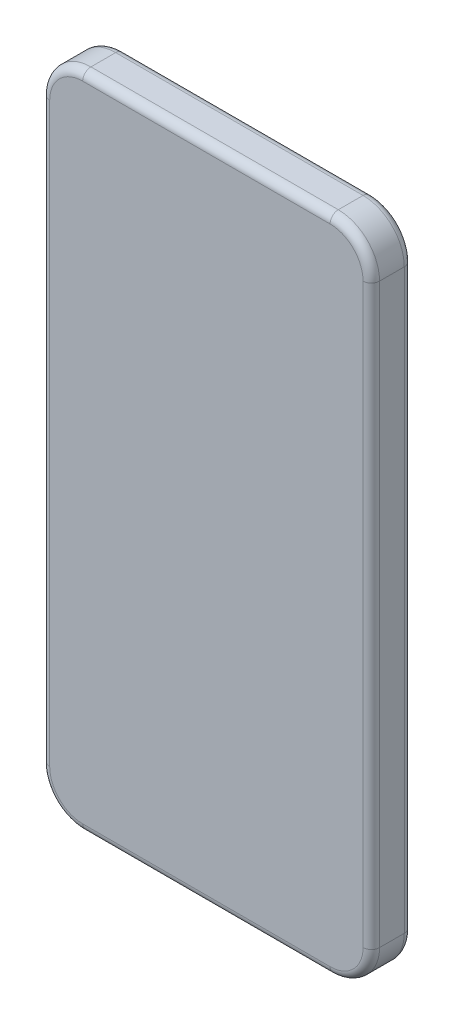
ISO-10303-21;
HEADER;
FILE_DESCRIPTION(('STEP AP214'),'2;1');
FILE_NAME('part.step','',(''),(''),'','','');
FILE_SCHEMA(('AUTOMOTIVE_DESIGN { 1 0 10303 214 1 1 1 1 }'));
ENDSEC;
DATA;
#1=APPLICATION_CONTEXT('core data for automotive mechanical design processes');
#2=APPLICATION_PROTOCOL_DEFINITION('international standard','automotive_design',2000,#1);
#3=PRODUCT_CONTEXT('',#1,'mechanical');
#4=PRODUCT('Part','Part','',(#3));
#5=PRODUCT_RELATED_PRODUCT_CATEGORY('part','',(#4));
#6=PRODUCT_DEFINITION_FORMATION('','',#4);
#7=PRODUCT_DEFINITION_CONTEXT('part definition',#1,'design');
#8=PRODUCT_DEFINITION('design','',#6,#7);
#9=PRODUCT_DEFINITION_SHAPE('','',#8);
#10=(LENGTH_UNIT() NAMED_UNIT(*) SI_UNIT(.MILLI.,.METRE.));
#11=(NAMED_UNIT(*) PLANE_ANGLE_UNIT() SI_UNIT($,.RADIAN.));
#12=(NAMED_UNIT(*) SI_UNIT($,.STERADIAN.) SOLID_ANGLE_UNIT());
#13=UNCERTAINTY_MEASURE_WITH_UNIT(LENGTH_MEASURE(1.E-05),#10,'distance_accuracy_value','');
#14=(GEOMETRIC_REPRESENTATION_CONTEXT(3) GLOBAL_UNCERTAINTY_ASSIGNED_CONTEXT((#13)) GLOBAL_UNIT_ASSIGNED_CONTEXT((#10,
#11,#12)) REPRESENTATION_CONTEXT('',''));
#15=CARTESIAN_POINT('',(0.,0.,0.));
#16=DIRECTION('',(0.,0.,1.));
#17=DIRECTION('',(1.,0.,0.));
#18=AXIS2_PLACEMENT_3D('',#15,#16,#17);
#19=CARTESIAN_POINT('',(30.,-70.,10.));
#20=DIRECTION('',(0.,0.,-1.));
#21=DIRECTION('',(-1.,0.,0.));
#22=AXIS2_PLACEMENT_3D('',#19,#20,#21);
#23=CYLINDRICAL_SURFACE('',#22,10.);
#24=DIRECTION('',(0.,0.,-1.));
#25=VECTOR('',#24,1.);
#26=CARTESIAN_POINT('',(29.9999999999999,-80.,10.));
#27=LINE('',#26,#25);
#28=CARTESIAN_POINT('',(29.9999999999999,-80.,8.));
#29=VERTEX_POINT('',#28);
#30=CARTESIAN_POINT('',(29.9999999999999,-80.,2.));
#31=VERTEX_POINT('',#30);
#32=EDGE_CURVE('E314',#29,#31,#27,.T.);
#33=ORIENTED_EDGE('',*,*,#32,.T.);
#34=CARTESIAN_POINT('',(30.,-70.,2.));
#35=DIRECTION('',(0.,0.,-1.));
#36=DIRECTION('',(-1.,0.,0.));
#37=AXIS2_PLACEMENT_3D('',#34,#35,#36);
#38=CIRCLE('',#37,10.);
#39=CARTESIAN_POINT('',(40.,-70.,2.));
#40=VERTEX_POINT('',#39);
#41=EDGE_CURVE('E263',#31,#40,#38,.F.);
#42=ORIENTED_EDGE('',*,*,#41,.T.);
#43=DIRECTION('',(0.,0.,-1.));
#44=VECTOR('',#43,1.);
#45=CARTESIAN_POINT('',(40.,-70.,10.));
#46=LINE('',#45,#44);
#47=CARTESIAN_POINT('',(40.,-70.,8.));
#48=VERTEX_POINT('',#47);
#49=EDGE_CURVE('E178',#48,#40,#46,.T.);
#50=ORIENTED_EDGE('',*,*,#49,.F.);
#51=CARTESIAN_POINT('',(30.,-70.,8.));
#52=DIRECTION('',(0.,0.,-1.));
#53=DIRECTION('',(-1.,0.,0.));
#54=AXIS2_PLACEMENT_3D('',#51,#52,#53);
#55=CIRCLE('',#54,10.);
#56=EDGE_CURVE('E260',#48,#29,#55,.T.);
#57=ORIENTED_EDGE('',*,*,#56,.T.);
#58=EDGE_LOOP('',(#33,#42,#50,#57));
#59=FACE_BOUND('',#58,.T.);
#60=ADVANCED_FACE('F39',(#59),#23,.T.);
#61=CARTESIAN_POINT('',(40.,69.9999999999999,10.));
#62=DIRECTION('',(-1.,0.,0.));
#63=DIRECTION('',(0.,-1.,0.));
#64=AXIS2_PLACEMENT_3D('',#61,#62,#63);
#65=PLANE('',#64);
#66=ORIENTED_EDGE('',*,*,#49,.T.);
#67=DIRECTION('',(0.,1.,0.));
#68=VECTOR('',#67,1.);
#69=CARTESIAN_POINT('',(40.,69.9999999999999,2.));
#70=LINE('',#69,#68);
#71=CARTESIAN_POINT('',(40.,69.9999999999999,2.));
#72=VERTEX_POINT('',#71);
#73=EDGE_CURVE('E176',#40,#72,#70,.T.);
#74=ORIENTED_EDGE('',*,*,#73,.T.);
#75=DIRECTION('',(0.,0.,-1.));
#76=VECTOR('',#75,1.);
#77=CARTESIAN_POINT('',(40.,69.9999999999999,10.));
#78=LINE('',#77,#76);
#79=CARTESIAN_POINT('',(40.,69.9999999999999,8.));
#80=VERTEX_POINT('',#79);
#81=EDGE_CURVE('E157',#80,#72,#78,.T.);
#82=ORIENTED_EDGE('',*,*,#81,.F.);
#83=DIRECTION('',(0.,1.,0.));
#84=VECTOR('',#83,1.);
#85=CARTESIAN_POINT('',(40.,69.9999999999999,8.));
#86=LINE('',#85,#84);
#87=EDGE_CURVE('E173',#80,#48,#86,.F.);
#88=ORIENTED_EDGE('',*,*,#87,.T.);
#89=EDGE_LOOP('',(#66,#74,#82,#88));
#90=FACE_BOUND('',#89,.T.);
#91=ADVANCED_FACE('F171',(#90),#65,.F.);
#92=CARTESIAN_POINT('',(30.,70.,10.));
#93=DIRECTION('',(0.,0.,-1.));
#94=DIRECTION('',(-1.,0.,0.));
#95=AXIS2_PLACEMENT_3D('',#92,#93,#94);
#96=CYLINDRICAL_SURFACE('',#95,10.);
#97=ORIENTED_EDGE('',*,*,#81,.T.);
#98=CARTESIAN_POINT('',(30.,70.,2.));
#99=DIRECTION('',(0.,0.,-1.));
#100=DIRECTION('',(-1.,0.,0.));
#101=AXIS2_PLACEMENT_3D('',#98,#99,#100);
#102=CIRCLE('',#101,10.);
#103=CARTESIAN_POINT('',(29.9999999999999,80.,2.));
#104=VERTEX_POINT('',#103);
#105=EDGE_CURVE('E165',#72,#104,#102,.F.);
#106=ORIENTED_EDGE('',*,*,#105,.T.);
#107=DIRECTION('',(0.,0.,-1.));
#108=VECTOR('',#107,1.);
#109=CARTESIAN_POINT('',(29.9999999999999,80.,10.));
#110=LINE('',#109,#108);
#111=CARTESIAN_POINT('',(29.9999999999999,80.,8.));
#112=VERTEX_POINT('',#111);
#113=EDGE_CURVE('E159',#112,#104,#110,.T.);
#114=ORIENTED_EDGE('',*,*,#113,.F.);
#115=CARTESIAN_POINT('',(30.,70.,8.));
#116=DIRECTION('',(0.,0.,-1.));
#117=DIRECTION('',(-1.,0.,0.));
#118=AXIS2_PLACEMENT_3D('',#115,#116,#117);
#119=CIRCLE('',#118,10.);
#120=EDGE_CURVE('E154',#112,#80,#119,.T.);
#121=ORIENTED_EDGE('',*,*,#120,.T.);
#122=EDGE_LOOP('',(#97,#106,#114,#121));
#123=FACE_BOUND('',#122,.T.);
#124=ADVANCED_FACE('F156',(#123),#96,.T.);
#125=CARTESIAN_POINT('',(29.9999999999999,80.,10.));
#126=DIRECTION('',(0.,-1.,0.));
#127=DIRECTION('',(1.,0.,0.));
#128=AXIS2_PLACEMENT_3D('',#125,#126,#127);
#129=PLANE('',#128);
#130=ORIENTED_EDGE('',*,*,#113,.T.);
#131=DIRECTION('',(-1.,0.,0.));
#132=VECTOR('',#131,1.);
#133=CARTESIAN_POINT('',(-29.9999999999999,80.,2.));
#134=LINE('',#133,#132);
#135=CARTESIAN_POINT('',(-29.9999999999999,80.,2.));
#136=VERTEX_POINT('',#135);
#137=EDGE_CURVE('E232',#104,#136,#134,.T.);
#138=ORIENTED_EDGE('',*,*,#137,.T.);
#139=DIRECTION('',(0.,0.,-1.));
#140=VECTOR('',#139,1.);
#141=CARTESIAN_POINT('',(-29.9999999999999,80.,10.));
#142=LINE('',#141,#140);
#143=CARTESIAN_POINT('',(-29.9999999999999,80.,8.));
#144=VERTEX_POINT('',#143);
#145=EDGE_CURVE('E346',#144,#136,#142,.T.);
#146=ORIENTED_EDGE('',*,*,#145,.F.);
#147=DIRECTION('',(-1.,0.,0.));
#148=VECTOR('',#147,1.);
#149=CARTESIAN_POINT('',(29.9999999999999,80.,8.));
#150=LINE('',#149,#148);
#151=EDGE_CURVE('E229',#144,#112,#150,.F.);
#152=ORIENTED_EDGE('',*,*,#151,.T.);
#153=EDGE_LOOP('',(#130,#138,#146,#152));
#154=FACE_BOUND('',#153,.T.);
#155=ADVANCED_FACE('F343',(#154),#129,.F.);
#156=CARTESIAN_POINT('',(-30.,70.,10.));
#157=DIRECTION('',(0.,0.,-1.));
#158=DIRECTION('',(-1.,0.,0.));
#159=AXIS2_PLACEMENT_3D('',#156,#157,#158);
#160=CYLINDRICAL_SURFACE('',#159,10.);
#161=ORIENTED_EDGE('',*,*,#145,.T.);
#162=CARTESIAN_POINT('',(-30.,70.,2.));
#163=DIRECTION('',(0.,0.,-1.));
#164=DIRECTION('',(-1.,0.,0.));
#165=AXIS2_PLACEMENT_3D('',#162,#163,#164);
#166=CIRCLE('',#165,10.);
#167=CARTESIAN_POINT('',(-40.,69.9999999999999,2.));
#168=VERTEX_POINT('',#167);
#169=EDGE_CURVE('E238',#136,#168,#166,.F.);
#170=ORIENTED_EDGE('',*,*,#169,.T.);
#171=DIRECTION('',(0.,0.,-1.));
#172=VECTOR('',#171,1.);
#173=CARTESIAN_POINT('',(-40.,69.9999999999999,10.));
#174=LINE('',#173,#172);
#175=CARTESIAN_POINT('',(-40.,69.9999999999999,8.));
#176=VERTEX_POINT('',#175);
#177=EDGE_CURVE('E350',#176,#168,#174,.T.);
#178=ORIENTED_EDGE('',*,*,#177,.F.);
#179=CARTESIAN_POINT('',(-30.,70.,8.));
#180=DIRECTION('',(0.,0.,-1.));
#181=DIRECTION('',(-1.,0.,0.));
#182=AXIS2_PLACEMENT_3D('',#179,#180,#181);
#183=CIRCLE('',#182,10.);
#184=EDGE_CURVE('E235',#176,#144,#183,.T.);
#185=ORIENTED_EDGE('',*,*,#184,.T.);
#186=EDGE_LOOP('',(#161,#170,#178,#185));
#187=FACE_BOUND('',#186,.T.);
#188=ADVANCED_FACE('F400',(#187),#160,.T.);
#189=CARTESIAN_POINT('',(-40.,69.9999999999999,10.));
#190=DIRECTION('',(1.,0.,0.));
#191=DIRECTION('',(0.,1.,0.));
#192=AXIS2_PLACEMENT_3D('',#189,#190,#191);
#193=PLANE('',#192);
#194=ORIENTED_EDGE('',*,*,#177,.T.);
#195=DIRECTION('',(0.,-1.,0.));
#196=VECTOR('',#195,1.);
#197=CARTESIAN_POINT('',(-40.,-70.,2.));
#198=LINE('',#197,#196);
#199=CARTESIAN_POINT('',(-40.,-70.,2.));
#200=VERTEX_POINT('',#199);
#201=EDGE_CURVE('E244',#168,#200,#198,.T.);
#202=ORIENTED_EDGE('',*,*,#201,.T.);
#203=DIRECTION('',(0.,0.,-1.));
#204=VECTOR('',#203,1.);
#205=CARTESIAN_POINT('',(-40.,-70.,10.));
#206=LINE('',#205,#204);
#207=CARTESIAN_POINT('',(-40.,-70.,8.));
#208=VERTEX_POINT('',#207);
#209=EDGE_CURVE('E356',#208,#200,#206,.T.);
#210=ORIENTED_EDGE('',*,*,#209,.F.);
#211=DIRECTION('',(0.,-1.,0.));
#212=VECTOR('',#211,1.);
#213=CARTESIAN_POINT('',(-40.,69.9999999999999,8.));
#214=LINE('',#213,#212);
#215=EDGE_CURVE('E241',#208,#176,#214,.F.);
#216=ORIENTED_EDGE('',*,*,#215,.T.);
#217=EDGE_LOOP('',(#194,#202,#210,#216));
#218=FACE_BOUND('',#217,.T.);
#219=ADVANCED_FACE('F403',(#218),#193,.F.);
#220=CARTESIAN_POINT('',(-30.,-70.,10.));
#221=DIRECTION('',(0.,0.,-1.));
#222=DIRECTION('',(-1.,0.,0.));
#223=AXIS2_PLACEMENT_3D('',#220,#221,#222);
#224=CYLINDRICAL_SURFACE('',#223,10.);
#225=ORIENTED_EDGE('',*,*,#209,.T.);
#226=CARTESIAN_POINT('',(-30.,-70.,2.));
#227=DIRECTION('',(0.,0.,-1.));
#228=DIRECTION('',(-1.,0.,0.));
#229=AXIS2_PLACEMENT_3D('',#226,#227,#228);
#230=CIRCLE('',#229,10.);
#231=CARTESIAN_POINT('',(-29.9999999999999,-80.,2.));
#232=VERTEX_POINT('',#231);
#233=EDGE_CURVE('E250',#200,#232,#230,.F.);
#234=ORIENTED_EDGE('',*,*,#233,.T.);
#235=DIRECTION('',(0.,0.,-1.));
#236=VECTOR('',#235,1.);
#237=CARTESIAN_POINT('',(-29.9999999999999,-80.,10.));
#238=LINE('',#237,#236);
#239=CARTESIAN_POINT('',(-29.9999999999999,-80.,8.));
#240=VERTEX_POINT('',#239);
#241=EDGE_CURVE('E362',#240,#232,#238,.T.);
#242=ORIENTED_EDGE('',*,*,#241,.F.);
#243=CARTESIAN_POINT('',(-30.,-70.,8.));
#244=DIRECTION('',(0.,0.,-1.));
#245=DIRECTION('',(-1.,0.,0.));
#246=AXIS2_PLACEMENT_3D('',#243,#244,#245);
#247=CIRCLE('',#246,10.);
#248=EDGE_CURVE('E247',#240,#208,#247,.T.);
#249=ORIENTED_EDGE('',*,*,#248,.T.);
#250=EDGE_LOOP('',(#225,#234,#242,#249));
#251=FACE_BOUND('',#250,.T.);
#252=ADVANCED_FACE('F417',(#251),#224,.T.);
#253=CARTESIAN_POINT('',(29.9999999999999,-80.,10.));
#254=DIRECTION('',(0.,1.,0.));
#255=DIRECTION('',(0.,0.,1.));
#256=AXIS2_PLACEMENT_3D('',#253,#254,#255);
#257=PLANE('',#256);
#258=ORIENTED_EDGE('',*,*,#241,.T.);
#259=DIRECTION('',(1.,0.,0.));
#260=VECTOR('',#259,1.);
#261=CARTESIAN_POINT('',(29.9999999999999,-80.,2.));
#262=LINE('',#261,#260);
#263=EDGE_CURVE('E257',#232,#31,#262,.T.);
#264=ORIENTED_EDGE('',*,*,#263,.T.);
#265=ORIENTED_EDGE('',*,*,#32,.F.);
#266=DIRECTION('',(1.,0.,0.));
#267=VECTOR('',#266,1.);
#268=CARTESIAN_POINT('',(29.9999999999999,-80.,8.));
#269=LINE('',#268,#267);
#270=EDGE_CURVE('E253',#29,#240,#269,.F.);
#271=ORIENTED_EDGE('',*,*,#270,.T.);
#272=EDGE_LOOP('',(#258,#264,#265,#271));
#273=FACE_BOUND('',#272,.T.);
#274=ADVANCED_FACE('F418',(#273),#257,.F.);
#275=CARTESIAN_POINT('',(30.,-70.,10.));
#276=DIRECTION('',(0.,0.,-1.));
#277=DIRECTION('',(-1.,0.,0.));
#278=AXIS2_PLACEMENT_3D('',#275,#276,#277);
#279=PLANE('',#278);
#280=CARTESIAN_POINT('',(-30.,-70.,10.));
#281=DIRECTION('',(0.,0.,-1.));
#282=DIRECTION('',(-1.,0.,0.));
#283=AXIS2_PLACEMENT_3D('',#280,#281,#282);
#284=CIRCLE('',#283,8.);
#285=CARTESIAN_POINT('',(-38.,-70.,10.));
#286=VERTEX_POINT('',#285);
#287=CARTESIAN_POINT('',(-29.9999999999999,-78.,10.));
#288=VERTEX_POINT('',#287);
#289=EDGE_CURVE('E49',#286,#288,#284,.F.);
#290=ORIENTED_EDGE('',*,*,#289,.T.);
#291=DIRECTION('',(1.,0.,0.));
#292=VECTOR('',#291,1.);
#293=CARTESIAN_POINT('',(30.,-78.,10.));
#294=LINE('',#293,#292);
#295=CARTESIAN_POINT('',(29.9999999999999,-78.,10.));
#296=VERTEX_POINT('',#295);
#297=EDGE_CURVE('E11',#288,#296,#294,.T.);
#298=ORIENTED_EDGE('',*,*,#297,.T.);
#299=CARTESIAN_POINT('',(30.,-70.,10.));
#300=DIRECTION('',(0.,0.,-1.));
#301=DIRECTION('',(-1.,0.,0.));
#302=AXIS2_PLACEMENT_3D('',#299,#300,#301);
#303=CIRCLE('',#302,8.);
#304=CARTESIAN_POINT('',(38.,-70.,10.));
#305=VERTEX_POINT('',#304);
#306=EDGE_CURVE('E266',#296,#305,#303,.F.);
#307=ORIENTED_EDGE('',*,*,#306,.T.);
#308=DIRECTION('',(0.,1.,0.));
#309=VECTOR('',#308,1.);
#310=CARTESIAN_POINT('',(38.,-70.,10.));
#311=LINE('',#310,#309);
#312=CARTESIAN_POINT('',(38.,69.9999999999999,10.));
#313=VERTEX_POINT('',#312);
#314=EDGE_CURVE('E269',#305,#313,#311,.T.);
#315=ORIENTED_EDGE('',*,*,#314,.T.);
#316=CARTESIAN_POINT('',(30.,70.,10.));
#317=DIRECTION('',(0.,0.,-1.));
#318=DIRECTION('',(-1.,0.,0.));
#319=AXIS2_PLACEMENT_3D('',#316,#317,#318);
#320=CIRCLE('',#319,8.);
#321=CARTESIAN_POINT('',(29.9999999999999,78.,10.));
#322=VERTEX_POINT('',#321);
#323=EDGE_CURVE('E184',#313,#322,#320,.F.);
#324=ORIENTED_EDGE('',*,*,#323,.T.);
#325=DIRECTION('',(-1.,0.,0.));
#326=VECTOR('',#325,1.);
#327=CARTESIAN_POINT('',(29.9999999999999,78.,10.));
#328=LINE('',#327,#326);
#329=CARTESIAN_POINT('',(-30.,77.9999999999999,10.));
#330=VERTEX_POINT('',#329);
#331=EDGE_CURVE('E274',#322,#330,#328,.T.);
#332=ORIENTED_EDGE('',*,*,#331,.T.);
#333=CARTESIAN_POINT('',(-30.,70.,10.));
#334=DIRECTION('',(0.,0.,-1.));
#335=DIRECTION('',(-1.,0.,0.));
#336=AXIS2_PLACEMENT_3D('',#333,#334,#335);
#337=CIRCLE('',#336,8.);
#338=CARTESIAN_POINT('',(-38.,69.9999999999999,10.));
#339=VERTEX_POINT('',#338);
#340=EDGE_CURVE('E277',#330,#339,#337,.F.);
#341=ORIENTED_EDGE('',*,*,#340,.T.);
#342=DIRECTION('',(0.,-1.,0.));
#343=VECTOR('',#342,1.);
#344=CARTESIAN_POINT('',(-38.,-70.0000000000001,10.));
#345=LINE('',#344,#343);
#346=EDGE_CURVE('E60',#339,#286,#345,.T.);
#347=ORIENTED_EDGE('',*,*,#346,.T.);
#348=EDGE_LOOP('',(#290,#298,#307,#315,#324,#332,#341,#347));
#349=FACE_BOUND('',#348,.T.);
#350=ADVANCED_FACE('F427',(#349),#279,.F.);
#351=CARTESIAN_POINT('',(30.,-70.,0.));
#352=DIRECTION('',(0.,0.,-1.));
#353=DIRECTION('',(-1.,0.,0.));
#354=AXIS2_PLACEMENT_3D('',#351,#352,#353);
#355=PLANE('',#354);
#356=CARTESIAN_POINT('',(30.,70.,0.));
#357=DIRECTION('',(0.,0.,-1.));
#358=DIRECTION('',(-1.,0.,0.));
#359=AXIS2_PLACEMENT_3D('',#356,#357,#358);
#360=CIRCLE('',#359,8.);
#361=CARTESIAN_POINT('',(29.9999999999999,78.,0.));
#362=VERTEX_POINT('',#361);
#363=CARTESIAN_POINT('',(38.,69.9999999999999,0.));
#364=VERTEX_POINT('',#363);
#365=EDGE_CURVE('E221',#362,#364,#360,.T.);
#366=ORIENTED_EDGE('',*,*,#365,.T.);
#367=DIRECTION('',(0.,1.,0.));
#368=VECTOR('',#367,1.);
#369=CARTESIAN_POINT('',(38.,-70.,0.));
#370=LINE('',#369,#368);
#371=CARTESIAN_POINT('',(38.,-70.,0.));
#372=VERTEX_POINT('',#371);
#373=EDGE_CURVE('E166',#364,#372,#370,.F.);
#374=ORIENTED_EDGE('',*,*,#373,.T.);
#375=CARTESIAN_POINT('',(30.,-70.,0.));
#376=DIRECTION('',(0.,0.,-1.));
#377=DIRECTION('',(-1.,0.,0.));
#378=AXIS2_PLACEMENT_3D('',#375,#376,#377);
#379=CIRCLE('',#378,8.);
#380=CARTESIAN_POINT('',(29.9999999999999,-78.,0.));
#381=VERTEX_POINT('',#380);
#382=EDGE_CURVE('E200',#372,#381,#379,.T.);
#383=ORIENTED_EDGE('',*,*,#382,.T.);
#384=DIRECTION('',(1.,0.,0.));
#385=VECTOR('',#384,1.);
#386=CARTESIAN_POINT('',(-29.9999999999999,-78.,0.));
#387=LINE('',#386,#385);
#388=CARTESIAN_POINT('',(-29.9999999999999,-78.,0.));
#389=VERTEX_POINT('',#388);
#390=EDGE_CURVE('E206',#381,#389,#387,.F.);
#391=ORIENTED_EDGE('',*,*,#390,.T.);
#392=CARTESIAN_POINT('',(-30.,-70.,0.));
#393=DIRECTION('',(0.,0.,-1.));
#394=DIRECTION('',(-1.,0.,0.));
#395=AXIS2_PLACEMENT_3D('',#392,#393,#394);
#396=CIRCLE('',#395,8.);
#397=CARTESIAN_POINT('',(-38.,-70.,0.));
#398=VERTEX_POINT('',#397);
#399=EDGE_CURVE('E209',#389,#398,#396,.T.);
#400=ORIENTED_EDGE('',*,*,#399,.T.);
#401=DIRECTION('',(0.,-1.,0.));
#402=VECTOR('',#401,1.);
#403=CARTESIAN_POINT('',(-38.,69.9999999999999,0.));
#404=LINE('',#403,#402);
#405=CARTESIAN_POINT('',(-38.,69.9999999999999,0.));
#406=VERTEX_POINT('',#405);
#407=EDGE_CURVE('E212',#398,#406,#404,.F.);
#408=ORIENTED_EDGE('',*,*,#407,.T.);
#409=CARTESIAN_POINT('',(-30.,70.,0.));
#410=DIRECTION('',(0.,0.,-1.));
#411=DIRECTION('',(-1.,0.,0.));
#412=AXIS2_PLACEMENT_3D('',#409,#410,#411);
#413=CIRCLE('',#412,8.);
#414=CARTESIAN_POINT('',(-29.9999999999999,78.,0.));
#415=VERTEX_POINT('',#414);
#416=EDGE_CURVE('E215',#406,#415,#413,.T.);
#417=ORIENTED_EDGE('',*,*,#416,.T.);
#418=DIRECTION('',(-1.,0.,0.));
#419=VECTOR('',#418,1.);
#420=CARTESIAN_POINT('',(29.9999999999999,78.,0.));
#421=LINE('',#420,#419);
#422=EDGE_CURVE('E218',#415,#362,#421,.F.);
#423=ORIENTED_EDGE('',*,*,#422,.T.);
#424=EDGE_LOOP('',(#366,#374,#383,#391,#400,#408,#417,#423));
#425=FACE_BOUND('',#424,.T.);
#426=ADVANCED_FACE('F429',(#425),#355,.T.);
#427=CARTESIAN_POINT('',(-38.,69.9999999999999,2.));
#428=DIRECTION('',(0.,1.,0.));
#429=DIRECTION('',(-1.,0.,0.));
#430=AXIS2_PLACEMENT_3D('',#427,#428,#429);
#431=CYLINDRICAL_SURFACE('',#430,2.);
#432=CARTESIAN_POINT('',(-38.,69.9999999999999,2.));
#433=DIRECTION('',(0.,1.,0.));
#434=DIRECTION('',(-1.,0.,0.));
#435=AXIS2_PLACEMENT_3D('',#432,#433,#434);
#436=CIRCLE('',#435,2.);
#437=EDGE_CURVE('E306',#406,#168,#436,.T.);
#438=ORIENTED_EDGE('',*,*,#437,.F.);
#439=ORIENTED_EDGE('',*,*,#407,.F.);
#440=CARTESIAN_POINT('',(-38.,-70.,2.));
#441=DIRECTION('',(0.,-1.,0.));
#442=DIRECTION('',(0.,0.,-1.));
#443=AXIS2_PLACEMENT_3D('',#440,#441,#442);
#444=CIRCLE('',#443,2.);
#445=EDGE_CURVE('E310',#200,#398,#444,.T.);
#446=ORIENTED_EDGE('',*,*,#445,.F.);
#447=ORIENTED_EDGE('',*,*,#201,.F.);
#448=EDGE_LOOP('',(#438,#439,#446,#447));
#449=FACE_BOUND('',#448,.T.);
#450=ADVANCED_FACE('F408',(#449),#431,.T.);
#451=CARTESIAN_POINT('',(-30.,-70.,2.));
#452=DIRECTION('',(0.,0.,-1.));
#453=DIRECTION('',(-1.,0.,0.));
#454=AXIS2_PLACEMENT_3D('',#451,#452,#453);
#455=TOROIDAL_SURFACE('',#454,8.,2.);
#456=ORIENTED_EDGE('',*,*,#445,.T.);
#457=ORIENTED_EDGE('',*,*,#399,.F.);
#458=CARTESIAN_POINT('',(-29.9999999999999,-78.,2.));
#459=DIRECTION('',(1.,0.,0.));
#460=DIRECTION('',(0.,1.,0.));
#461=AXIS2_PLACEMENT_3D('',#458,#459,#460);
#462=CIRCLE('',#461,2.);
#463=EDGE_CURVE('E302',#232,#389,#462,.T.);
#464=ORIENTED_EDGE('',*,*,#463,.F.);
#465=ORIENTED_EDGE('',*,*,#233,.F.);
#466=EDGE_LOOP('',(#456,#457,#464,#465));
#467=FACE_BOUND('',#466,.T.);
#468=ADVANCED_FACE('F414',(#467),#455,.T.);
#469=CARTESIAN_POINT('',(-30.,70.,2.));
#470=DIRECTION('',(0.,0.,-1.));
#471=DIRECTION('',(-1.,0.,0.));
#472=AXIS2_PLACEMENT_3D('',#469,#470,#471);
#473=TOROIDAL_SURFACE('',#472,8.,2.);
#474=ORIENTED_EDGE('',*,*,#437,.T.);
#475=ORIENTED_EDGE('',*,*,#169,.F.);
#476=CARTESIAN_POINT('',(-29.9999999999999,78.,2.));
#477=DIRECTION('',(1.,0.,0.));
#478=DIRECTION('',(0.,0.,-1.));
#479=AXIS2_PLACEMENT_3D('',#476,#477,#478);
#480=CIRCLE('',#479,2.);
#481=EDGE_CURVE('E298',#415,#136,#480,.T.);
#482=ORIENTED_EDGE('',*,*,#481,.F.);
#483=ORIENTED_EDGE('',*,*,#416,.F.);
#484=EDGE_LOOP('',(#474,#475,#482,#483));
#485=FACE_BOUND('',#484,.T.);
#486=ADVANCED_FACE('F397',(#485),#473,.T.);
#487=CARTESIAN_POINT('',(29.9999999999999,-78.,2.));
#488=DIRECTION('',(-1.,0.,0.));
#489=DIRECTION('',(0.,0.,1.));
#490=AXIS2_PLACEMENT_3D('',#487,#488,#489);
#491=CYLINDRICAL_SURFACE('',#490,2.);
#492=ORIENTED_EDGE('',*,*,#463,.T.);
#493=ORIENTED_EDGE('',*,*,#390,.F.);
#494=CARTESIAN_POINT('',(29.9999999999999,-78.,2.));
#495=DIRECTION('',(1.,0.,0.));
#496=DIRECTION('',(0.,0.,-1.));
#497=AXIS2_PLACEMENT_3D('',#494,#495,#496);
#498=CIRCLE('',#497,2.);
#499=EDGE_CURVE('E294',#31,#381,#498,.T.);
#500=ORIENTED_EDGE('',*,*,#499,.F.);
#501=ORIENTED_EDGE('',*,*,#263,.F.);
#502=EDGE_LOOP('',(#492,#493,#500,#501));
#503=FACE_BOUND('',#502,.T.);
#504=ADVANCED_FACE('F377',(#503),#491,.T.);
#505=CARTESIAN_POINT('',(29.9999999999999,78.,2.));
#506=DIRECTION('',(1.,0.,0.));
#507=DIRECTION('',(0.,1.,0.));
#508=AXIS2_PLACEMENT_3D('',#505,#506,#507);
#509=CYLINDRICAL_SURFACE('',#508,2.);
#510=ORIENTED_EDGE('',*,*,#481,.T.);
#511=ORIENTED_EDGE('',*,*,#137,.F.);
#512=CARTESIAN_POINT('',(29.9999999999999,78.,2.));
#513=DIRECTION('',(1.,0.,0.));
#514=DIRECTION('',(0.,1.,0.));
#515=AXIS2_PLACEMENT_3D('',#512,#513,#514);
#516=CIRCLE('',#515,2.);
#517=EDGE_CURVE('E290',#362,#104,#516,.T.);
#518=ORIENTED_EDGE('',*,*,#517,.F.);
#519=ORIENTED_EDGE('',*,*,#422,.F.);
#520=EDGE_LOOP('',(#510,#511,#518,#519));
#521=FACE_BOUND('',#520,.T.);
#522=ADVANCED_FACE('F393',(#521),#509,.T.);
#523=CARTESIAN_POINT('',(30.,-70.,2.));
#524=DIRECTION('',(0.,0.,-1.));
#525=DIRECTION('',(-1.,0.,0.));
#526=AXIS2_PLACEMENT_3D('',#523,#524,#525);
#527=TOROIDAL_SURFACE('',#526,8.,2.);
#528=ORIENTED_EDGE('',*,*,#499,.T.);
#529=ORIENTED_EDGE('',*,*,#382,.F.);
#530=CARTESIAN_POINT('',(38.,-70.,2.));
#531=DIRECTION('',(0.,1.,0.));
#532=DIRECTION('',(0.,0.,1.));
#533=AXIS2_PLACEMENT_3D('',#530,#531,#532);
#534=CIRCLE('',#533,2.);
#535=EDGE_CURVE('E287',#40,#372,#534,.T.);
#536=ORIENTED_EDGE('',*,*,#535,.F.);
#537=ORIENTED_EDGE('',*,*,#41,.F.);
#538=EDGE_LOOP('',(#528,#529,#536,#537));
#539=FACE_BOUND('',#538,.T.);
#540=ADVANCED_FACE('F381',(#539),#527,.T.);
#541=CARTESIAN_POINT('',(30.,70.,2.));
#542=DIRECTION('',(0.,0.,-1.));
#543=DIRECTION('',(-1.,0.,0.));
#544=AXIS2_PLACEMENT_3D('',#541,#542,#543);
#545=TOROIDAL_SURFACE('',#544,8.,2.);
#546=ORIENTED_EDGE('',*,*,#517,.T.);
#547=ORIENTED_EDGE('',*,*,#105,.F.);
#548=CARTESIAN_POINT('',(38.,69.9999999999999,2.));
#549=DIRECTION('',(0.,-1.,0.));
#550=DIRECTION('',(0.,0.,-1.));
#551=AXIS2_PLACEMENT_3D('',#548,#549,#550);
#552=CIRCLE('',#551,2.);
#553=EDGE_CURVE('E284',#364,#72,#552,.T.);
#554=ORIENTED_EDGE('',*,*,#553,.F.);
#555=ORIENTED_EDGE('',*,*,#365,.F.);
#556=EDGE_LOOP('',(#546,#547,#554,#555));
#557=FACE_BOUND('',#556,.T.);
#558=ADVANCED_FACE('F389',(#557),#545,.T.);
#559=CARTESIAN_POINT('',(38.,69.9999999999999,2.));
#560=DIRECTION('',(0.,-1.,0.));
#561=DIRECTION('',(1.,0.,0.));
#562=AXIS2_PLACEMENT_3D('',#559,#560,#561);
#563=CYLINDRICAL_SURFACE('',#562,2.);
#564=ORIENTED_EDGE('',*,*,#535,.T.);
#565=ORIENTED_EDGE('',*,*,#373,.F.);
#566=ORIENTED_EDGE('',*,*,#553,.T.);
#567=ORIENTED_EDGE('',*,*,#73,.F.);
#568=EDGE_LOOP('',(#564,#565,#566,#567));
#569=FACE_BOUND('',#568,.T.);
#570=ADVANCED_FACE('F384',(#569),#563,.T.);
#571=CARTESIAN_POINT('',(29.9999999999999,78.,8.));
#572=DIRECTION('',(-1.,0.,0.));
#573=DIRECTION('',(0.,-1.,0.));
#574=AXIS2_PLACEMENT_3D('',#571,#572,#573);
#575=CYLINDRICAL_SURFACE('',#574,2.);
#576=CARTESIAN_POINT('',(29.9999999999999,78.,8.));
#577=DIRECTION('',(1.,0.,0.));
#578=DIRECTION('',(0.,0.,-1.));
#579=AXIS2_PLACEMENT_3D('',#576,#577,#578);
#580=CIRCLE('',#579,2.);
#581=EDGE_CURVE('E328',#112,#322,#580,.T.);
#582=ORIENTED_EDGE('',*,*,#581,.F.);
#583=ORIENTED_EDGE('',*,*,#151,.F.);
#584=CARTESIAN_POINT('',(-30.,77.9999999999999,8.));
#585=DIRECTION('',(-1.,0.,0.));
#586=DIRECTION('',(0.,-1.,0.));
#587=AXIS2_PLACEMENT_3D('',#584,#585,#586);
#588=CIRCLE('',#587,2.);
#589=EDGE_CURVE('E43',#330,#144,#588,.T.);
#590=ORIENTED_EDGE('',*,*,#589,.F.);
#591=ORIENTED_EDGE('',*,*,#331,.F.);
#592=EDGE_LOOP('',(#582,#583,#590,#591));
#593=FACE_BOUND('',#592,.T.);
#594=ADVANCED_FACE('F41',(#593),#575,.T.);
#595=CARTESIAN_POINT('',(-30.,70.,8.));
#596=DIRECTION('',(0.,0.,-1.));
#597=DIRECTION('',(-1.,0.,0.));
#598=AXIS2_PLACEMENT_3D('',#595,#596,#597);
#599=TOROIDAL_SURFACE('',#598,8.,2.);
#600=ORIENTED_EDGE('',*,*,#589,.T.);
#601=ORIENTED_EDGE('',*,*,#184,.F.);
#602=CARTESIAN_POINT('',(-38.,69.9999999999999,8.));
#603=DIRECTION('',(0.,-1.,0.));
#604=DIRECTION('',(0.,0.,-1.));
#605=AXIS2_PLACEMENT_3D('',#602,#603,#604);
#606=CIRCLE('',#605,2.);
#607=EDGE_CURVE('E188',#339,#176,#606,.T.);
#608=ORIENTED_EDGE('',*,*,#607,.F.);
#609=ORIENTED_EDGE('',*,*,#340,.F.);
#610=EDGE_LOOP('',(#600,#601,#608,#609));
#611=FACE_BOUND('',#610,.T.);
#612=ADVANCED_FACE('F336',(#611),#599,.T.);
#613=CARTESIAN_POINT('',(30.,70.,8.));
#614=DIRECTION('',(0.,0.,-1.));
#615=DIRECTION('',(-1.,0.,0.));
#616=AXIS2_PLACEMENT_3D('',#613,#614,#615);
#617=TOROIDAL_SURFACE('',#616,8.,2.);
#618=ORIENTED_EDGE('',*,*,#581,.T.);
#619=ORIENTED_EDGE('',*,*,#323,.F.);
#620=CARTESIAN_POINT('',(38.,69.9999999999999,8.));
#621=DIRECTION('',(0.,-1.,0.));
#622=DIRECTION('',(1.,0.,0.));
#623=AXIS2_PLACEMENT_3D('',#620,#621,#622);
#624=CIRCLE('',#623,2.);
#625=EDGE_CURVE('E182',#80,#313,#624,.T.);
#626=ORIENTED_EDGE('',*,*,#625,.F.);
#627=ORIENTED_EDGE('',*,*,#120,.F.);
#628=EDGE_LOOP('',(#618,#619,#626,#627));
#629=FACE_BOUND('',#628,.T.);
#630=ADVANCED_FACE('F183',(#629),#617,.T.);
#631=CARTESIAN_POINT('',(-38.,-70.0000000000001,8.));
#632=DIRECTION('',(0.,-1.,0.));
#633=DIRECTION('',(1.,0.,0.));
#634=AXIS2_PLACEMENT_3D('',#631,#632,#633);
#635=CYLINDRICAL_SURFACE('',#634,2.);
#636=ORIENTED_EDGE('',*,*,#607,.T.);
#637=ORIENTED_EDGE('',*,*,#215,.F.);
#638=CARTESIAN_POINT('',(-38.,-70.,8.));
#639=DIRECTION('',(0.,-1.,0.));
#640=DIRECTION('',(1.,0.,0.));
#641=AXIS2_PLACEMENT_3D('',#638,#639,#640);
#642=CIRCLE('',#641,2.);
#643=EDGE_CURVE('E189',#286,#208,#642,.T.);
#644=ORIENTED_EDGE('',*,*,#643,.F.);
#645=ORIENTED_EDGE('',*,*,#346,.F.);
#646=EDGE_LOOP('',(#636,#637,#644,#645));
#647=FACE_BOUND('',#646,.T.);
#648=ADVANCED_FACE('F472',(#647),#635,.T.);
#649=CARTESIAN_POINT('',(38.,-70.,8.));
#650=DIRECTION('',(0.,1.,0.));
#651=DIRECTION('',(-1.,0.,0.));
#652=AXIS2_PLACEMENT_3D('',#649,#650,#651);
#653=CYLINDRICAL_SURFACE('',#652,2.);
#654=ORIENTED_EDGE('',*,*,#625,.T.);
#655=ORIENTED_EDGE('',*,*,#314,.F.);
#656=CARTESIAN_POINT('',(38.,-70.,8.));
#657=DIRECTION('',(0.,-1.,0.));
#658=DIRECTION('',(0.,0.,-1.));
#659=AXIS2_PLACEMENT_3D('',#656,#657,#658);
#660=CIRCLE('',#659,2.);
#661=EDGE_CURVE('E194',#48,#305,#660,.T.);
#662=ORIENTED_EDGE('',*,*,#661,.F.);
#663=ORIENTED_EDGE('',*,*,#87,.F.);
#664=EDGE_LOOP('',(#654,#655,#662,#663));
#665=FACE_BOUND('',#664,.T.);
#666=ADVANCED_FACE('F192',(#665),#653,.T.);
#667=CARTESIAN_POINT('',(-30.,-70.,8.));
#668=DIRECTION('',(0.,0.,-1.));
#669=DIRECTION('',(-1.,0.,0.));
#670=AXIS2_PLACEMENT_3D('',#667,#668,#669);
#671=TOROIDAL_SURFACE('',#670,8.,2.);
#672=ORIENTED_EDGE('',*,*,#643,.T.);
#673=ORIENTED_EDGE('',*,*,#248,.F.);
#674=CARTESIAN_POINT('',(-29.9999999999999,-78.,8.));
#675=DIRECTION('',(1.,0.,0.));
#676=DIRECTION('',(0.,0.,-1.));
#677=AXIS2_PLACEMENT_3D('',#674,#675,#676);
#678=CIRCLE('',#677,2.);
#679=EDGE_CURVE('E318',#288,#240,#678,.T.);
#680=ORIENTED_EDGE('',*,*,#679,.F.);
#681=ORIENTED_EDGE('',*,*,#289,.F.);
#682=EDGE_LOOP('',(#672,#673,#680,#681));
#683=FACE_BOUND('',#682,.T.);
#684=ADVANCED_FACE('F466',(#683),#671,.T.);
#685=CARTESIAN_POINT('',(30.,-70.,8.));
#686=DIRECTION('',(0.,0.,-1.));
#687=DIRECTION('',(-1.,0.,0.));
#688=AXIS2_PLACEMENT_3D('',#685,#686,#687);
#689=TOROIDAL_SURFACE('',#688,8.,2.);
#690=ORIENTED_EDGE('',*,*,#661,.T.);
#691=ORIENTED_EDGE('',*,*,#306,.F.);
#692=CARTESIAN_POINT('',(30.,-78.,8.));
#693=DIRECTION('',(-1.,0.,0.));
#694=DIRECTION('',(0.,0.,1.));
#695=AXIS2_PLACEMENT_3D('',#692,#693,#694);
#696=CIRCLE('',#695,2.);
#697=EDGE_CURVE('E315',#29,#296,#696,.T.);
#698=ORIENTED_EDGE('',*,*,#697,.F.);
#699=ORIENTED_EDGE('',*,*,#56,.F.);
#700=EDGE_LOOP('',(#690,#691,#698,#699));
#701=FACE_BOUND('',#700,.T.);
#702=ADVANCED_FACE('F426',(#701),#689,.T.);
#703=CARTESIAN_POINT('',(30.,-78.,8.));
#704=DIRECTION('',(1.,0.,0.));
#705=DIRECTION('',(0.,0.,-1.));
#706=AXIS2_PLACEMENT_3D('',#703,#704,#705);
#707=CYLINDRICAL_SURFACE('',#706,2.);
#708=ORIENTED_EDGE('',*,*,#679,.T.);
#709=ORIENTED_EDGE('',*,*,#270,.F.);
#710=ORIENTED_EDGE('',*,*,#697,.T.);
#711=ORIENTED_EDGE('',*,*,#297,.F.);
#712=EDGE_LOOP('',(#708,#709,#710,#711));
#713=FACE_BOUND('',#712,.T.);
#714=ADVANCED_FACE('F421',(#713),#707,.T.);
#715=CLOSED_SHELL('',(#60,#91,#124,#155,#188,#219,#252,#274,#350,#426,#450,#468,#486,#504,#522,
#540,#558,#570,#594,#612,#630,#648,#666,#684,#702,#714));
#716=MANIFOLD_SOLID_BREP('B2',#715);
#717=ADVANCED_BREP_SHAPE_REPRESENTATION('',(#18,#716),#14);
#718=SHAPE_DEFINITION_REPRESENTATION(#9,#717);
ENDSEC;
END-ISO-10303-21;
